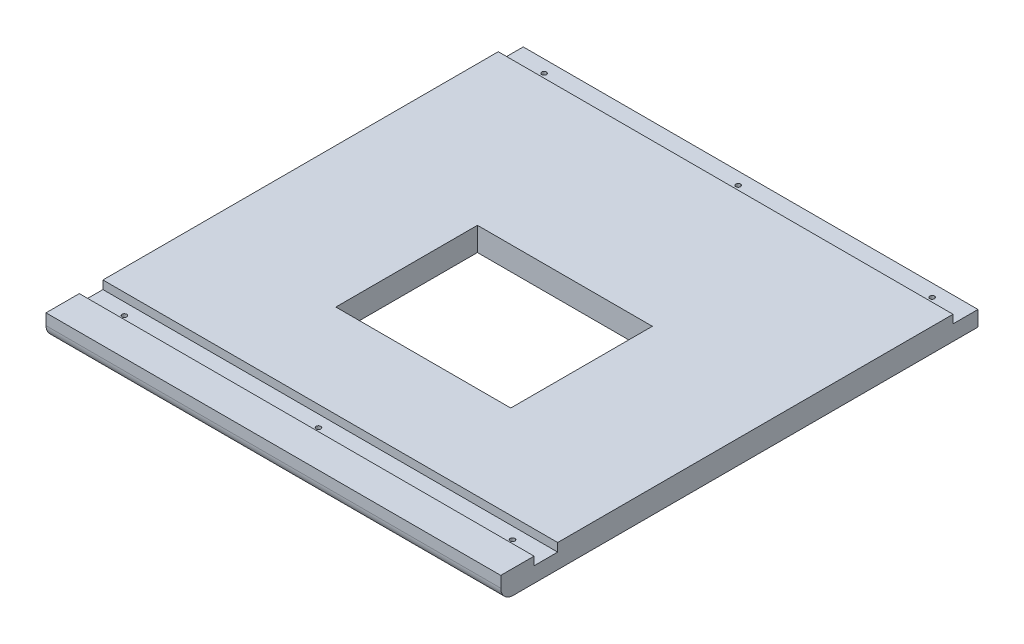
ISO-10303-21;
HEADER;
FILE_DESCRIPTION(('STEP AP214'),'2;1');
FILE_NAME('part.step','',(''),(''),'','','');
FILE_SCHEMA(('AUTOMOTIVE_DESIGN { 1 0 10303 214 1 1 1 1 }'));
ENDSEC;
DATA;
#1=APPLICATION_CONTEXT('core data for automotive mechanical design processes');
#2=APPLICATION_PROTOCOL_DEFINITION('international standard','automotive_design',2000,#1);
#3=PRODUCT_CONTEXT('',#1,'mechanical');
#4=PRODUCT('Part','Part','',(#3));
#5=PRODUCT_RELATED_PRODUCT_CATEGORY('part','',(#4));
#6=PRODUCT_DEFINITION_FORMATION('','',#4);
#7=PRODUCT_DEFINITION_CONTEXT('part definition',#1,'design');
#8=PRODUCT_DEFINITION('design','',#6,#7);
#9=PRODUCT_DEFINITION_SHAPE('','',#8);
#10=(LENGTH_UNIT() NAMED_UNIT(*) SI_UNIT(.MILLI.,.METRE.));
#11=(NAMED_UNIT(*) PLANE_ANGLE_UNIT() SI_UNIT($,.RADIAN.));
#12=(NAMED_UNIT(*) SI_UNIT($,.STERADIAN.) SOLID_ANGLE_UNIT());
#13=UNCERTAINTY_MEASURE_WITH_UNIT(LENGTH_MEASURE(1.E-05),#10,'distance_accuracy_value','');
#14=(GEOMETRIC_REPRESENTATION_CONTEXT(3) GLOBAL_UNCERTAINTY_ASSIGNED_CONTEXT((#13)) GLOBAL_UNIT_ASSIGNED_CONTEXT((#10,
#11,#12)) REPRESENTATION_CONTEXT('',''));
#15=CARTESIAN_POINT('',(0.,0.,0.));
#16=DIRECTION('',(0.,0.,1.));
#17=DIRECTION('',(1.,0.,0.));
#18=AXIS2_PLACEMENT_3D('',#15,#16,#17);
#19=CARTESIAN_POINT('',(0.,18.,0.));
#20=DIRECTION('',(0.,0.,1.));
#21=DIRECTION('',(1.,0.,0.));
#22=AXIS2_PLACEMENT_3D('',#19,#20,#21);
#23=PLANE('',#22);
#24=DIRECTION('',(1.,0.,0.));
#25=VECTOR('',#24,1.);
#26=CARTESIAN_POINT('',(0.,11.65,0.));
#27=LINE('',#26,#25);
#28=CARTESIAN_POINT('',(0.,11.65,0.));
#29=VERTEX_POINT('',#28);
#30=CARTESIAN_POINT('',(346.7,11.65,0.));
#31=VERTEX_POINT('',#30);
#32=EDGE_CURVE('E197',#29,#31,#27,.T.);
#33=ORIENTED_EDGE('',*,*,#32,.T.);
#34=DIRECTION('',(0.,-1.,0.));
#35=VECTOR('',#34,1.);
#36=CARTESIAN_POINT('',(346.7,18.,0.));
#37=LINE('',#36,#35);
#38=CARTESIAN_POINT('',(346.7,0.,0.));
#39=VERTEX_POINT('',#38);
#40=EDGE_CURVE('E162',#31,#39,#37,.T.);
#41=ORIENTED_EDGE('',*,*,#40,.T.);
#42=DIRECTION('',(-1.,0.,0.));
#43=VECTOR('',#42,1.);
#44=CARTESIAN_POINT('',(0.,0.,0.));
#45=LINE('',#44,#43);
#46=CARTESIAN_POINT('',(0.,0.,0.));
#47=VERTEX_POINT('',#46);
#48=EDGE_CURVE('E173',#39,#47,#45,.T.);
#49=ORIENTED_EDGE('',*,*,#48,.T.);
#50=DIRECTION('',(0.,-1.,0.));
#51=VECTOR('',#50,1.);
#52=CARTESIAN_POINT('',(0.,18.,0.));
#53=LINE('',#52,#51);
#54=EDGE_CURVE('E159',#29,#47,#53,.T.);
#55=ORIENTED_EDGE('',*,*,#54,.F.);
#56=EDGE_LOOP('',(#33,#41,#49,#55));
#57=FACE_BOUND('',#56,.T.);
#58=ADVANCED_FACE('F33',(#57),#23,.F.);
#59=CARTESIAN_POINT('',(0.,18.,0.));
#60=DIRECTION('',(0.,1.,0.));
#61=DIRECTION('',(0.,0.,1.));
#62=AXIS2_PLACEMENT_3D('',#59,#60,#61);
#63=PLANE('',#62);
#64=DIRECTION('',(-1.,0.,0.));
#65=VECTOR('',#64,1.);
#66=CARTESIAN_POINT('',(0.,18.,363.85000001));
#67=LINE('',#66,#65);
#68=CARTESIAN_POINT('',(346.7,18.,363.85000001));
#69=VERTEX_POINT('',#68);
#70=CARTESIAN_POINT('',(0.,18.,363.85000001));
#71=VERTEX_POINT('',#70);
#72=EDGE_CURVE('E139',#69,#71,#67,.T.);
#73=ORIENTED_EDGE('',*,*,#72,.F.);
#74=DIRECTION('',(0.,0.,-1.));
#75=VECTOR('',#74,1.);
#76=CARTESIAN_POINT('',(346.7,18.,0.));
#77=LINE('',#76,#75);
#78=CARTESIAN_POINT('',(346.7,18.,338.45000001));
#79=VERTEX_POINT('',#78);
#80=EDGE_CURVE('E149',#69,#79,#77,.T.);
#81=ORIENTED_EDGE('',*,*,#80,.T.);
#82=DIRECTION('',(1.,0.,0.));
#83=VECTOR('',#82,1.);
#84=CARTESIAN_POINT('',(346.7,18.,338.45000001));
#85=LINE('',#84,#83);
#86=CARTESIAN_POINT('',(0.,18.,338.45000001));
#87=VERTEX_POINT('',#86);
#88=EDGE_CURVE('E469',#87,#79,#85,.T.);
#89=ORIENTED_EDGE('',*,*,#88,.F.);
#90=DIRECTION('',(0.,0.,1.));
#91=VECTOR('',#90,1.);
#92=CARTESIAN_POINT('',(0.,18.,0.));
#93=LINE('',#92,#91);
#94=EDGE_CURVE('E152',#87,#71,#93,.T.);
#95=ORIENTED_EDGE('',*,*,#94,.T.);
#96=EDGE_LOOP('',(#73,#81,#89,#95));
#97=FACE_BOUND('',#96,.T.);
#98=ADVANCED_FACE('F147',(#97),#63,.T.);
#99=CARTESIAN_POINT('',(0.,18.,0.));
#100=DIRECTION('',(1.,0.,0.));
#101=DIRECTION('',(0.,0.,-1.));
#102=AXIS2_PLACEMENT_3D('',#99,#100,#101);
#103=PLANE('',#102);
#104=DIRECTION('',(0.,0.,1.));
#105=VECTOR('',#104,1.);
#106=CARTESIAN_POINT('',(0.,0.,0.));
#107=LINE('',#106,#105);
#108=CARTESIAN_POINT('',(0.,0.,354.32500001));
#109=VERTEX_POINT('',#108);
#110=EDGE_CURVE('E169',#47,#109,#107,.T.);
#111=ORIENTED_EDGE('',*,*,#110,.T.);
#112=CARTESIAN_POINT('',(0.,9.525,354.32500001));
#113=DIRECTION('',(1.,0.,0.));
#114=DIRECTION('',(0.,0.,-1.));
#115=AXIS2_PLACEMENT_3D('',#112,#113,#114);
#116=CIRCLE('',#115,9.525);
#117=CARTESIAN_POINT('',(0.,9.525,363.85000001));
#118=VERTEX_POINT('',#117);
#119=EDGE_CURVE('E55',#109,#118,#116,.F.);
#120=ORIENTED_EDGE('',*,*,#119,.T.);
#121=DIRECTION('',(0.,1.,0.));
#122=VECTOR('',#121,1.);
#123=CARTESIAN_POINT('',(0.,0.,363.85000001));
#124=LINE('',#123,#122);
#125=EDGE_CURVE('E144',#118,#71,#124,.T.);
#126=ORIENTED_EDGE('',*,*,#125,.T.);
#127=ORIENTED_EDGE('',*,*,#94,.F.);
#128=DIRECTION('',(0.,1.,0.));
#129=VECTOR('',#128,1.);
#130=CARTESIAN_POINT('',(0.,11.65,338.45000001));
#131=LINE('',#130,#129);
#132=CARTESIAN_POINT('',(0.,11.65,338.45000001));
#133=VERTEX_POINT('',#132);
#134=EDGE_CURVE('E482',#133,#87,#131,.T.);
#135=ORIENTED_EDGE('',*,*,#134,.F.);
#136=DIRECTION('',(0.,0.,1.));
#137=VECTOR('',#136,1.);
#138=CARTESIAN_POINT('',(0.,11.65,338.45000001));
#139=LINE('',#138,#137);
#140=CARTESIAN_POINT('',(0.,11.65,320.45000001));
#141=VERTEX_POINT('',#140);
#142=EDGE_CURVE('E472',#141,#133,#139,.T.);
#143=ORIENTED_EDGE('',*,*,#142,.F.);
#144=DIRECTION('',(0.,1.,0.));
#145=VECTOR('',#144,1.);
#146=CARTESIAN_POINT('',(0.,11.65,320.45000001));
#147=LINE('',#146,#145);
#148=CARTESIAN_POINT('',(0.,18.,320.45000001));
#149=VERTEX_POINT('',#148);
#150=EDGE_CURVE('E484',#141,#149,#147,.T.);
#151=ORIENTED_EDGE('',*,*,#150,.T.);
#152=CARTESIAN_POINT('',(0.,18.,19.05));
#153=VERTEX_POINT('',#152);
#154=EDGE_CURVE('E165',#153,#149,#93,.T.);
#155=ORIENTED_EDGE('',*,*,#154,.F.);
#156=DIRECTION('',(0.,1.,0.));
#157=VECTOR('',#156,1.);
#158=CARTESIAN_POINT('',(0.,-335.572972310301,19.05));
#159=LINE('',#158,#157);
#160=CARTESIAN_POINT('',(0.,11.65,19.05));
#161=VERTEX_POINT('',#160);
#162=EDGE_CURVE('E428',#161,#153,#159,.T.);
#163=ORIENTED_EDGE('',*,*,#162,.F.);
#164=DIRECTION('',(0.,0.,-1.));
#165=VECTOR('',#164,1.);
#166=CARTESIAN_POINT('',(0.,11.65,0.));
#167=LINE('',#166,#165);
#168=EDGE_CURVE('E193',#161,#29,#167,.T.);
#169=ORIENTED_EDGE('',*,*,#168,.T.);
#170=ORIENTED_EDGE('',*,*,#54,.T.);
#171=EDGE_LOOP('',(#111,#120,#126,#127,#135,#143,#151,#155,#163,#169,#170));
#172=FACE_BOUND('',#171,.T.);
#173=ADVANCED_FACE('F188',(#172),#103,.F.);
#174=CARTESIAN_POINT('',(346.7,18.,0.));
#175=DIRECTION('',(-1.,0.,0.));
#176=DIRECTION('',(0.,0.,1.));
#177=AXIS2_PLACEMENT_3D('',#174,#175,#176);
#178=PLANE('',#177);
#179=DIRECTION('',(0.,1.,0.));
#180=VECTOR('',#179,1.);
#181=CARTESIAN_POINT('',(346.7,0.,363.85000001));
#182=LINE('',#181,#180);
#183=CARTESIAN_POINT('',(346.7,9.525,363.85000001));
#184=VERTEX_POINT('',#183);
#185=EDGE_CURVE('E136',#184,#69,#182,.T.);
#186=ORIENTED_EDGE('',*,*,#185,.F.);
#187=CARTESIAN_POINT('',(346.7,9.525,354.32500001));
#188=DIRECTION('',(-1.,0.,0.));
#189=DIRECTION('',(0.,0.,1.));
#190=AXIS2_PLACEMENT_3D('',#187,#188,#189);
#191=CIRCLE('',#190,9.525);
#192=CARTESIAN_POINT('',(346.7,0.,354.32500001));
#193=VERTEX_POINT('',#192);
#194=EDGE_CURVE('E11',#184,#193,#191,.F.);
#195=ORIENTED_EDGE('',*,*,#194,.T.);
#196=DIRECTION('',(0.,0.,-1.));
#197=VECTOR('',#196,1.);
#198=CARTESIAN_POINT('',(346.7,0.,0.));
#199=LINE('',#198,#197);
#200=EDGE_CURVE('E171',#193,#39,#199,.T.);
#201=ORIENTED_EDGE('',*,*,#200,.T.);
#202=ORIENTED_EDGE('',*,*,#40,.F.);
#203=DIRECTION('',(0.,0.,1.));
#204=VECTOR('',#203,1.);
#205=CARTESIAN_POINT('',(346.7,11.65,0.));
#206=LINE('',#205,#204);
#207=CARTESIAN_POINT('',(346.7,11.65,19.05));
#208=VERTEX_POINT('',#207);
#209=EDGE_CURVE('E200',#31,#208,#206,.T.);
#210=ORIENTED_EDGE('',*,*,#209,.T.);
#211=DIRECTION('',(0.,1.,0.));
#212=VECTOR('',#211,1.);
#213=CARTESIAN_POINT('',(346.7,-335.572972310301,19.05));
#214=LINE('',#213,#212);
#215=CARTESIAN_POINT('',(346.7,18.,19.05));
#216=VERTEX_POINT('',#215);
#217=EDGE_CURVE('E423',#208,#216,#214,.T.);
#218=ORIENTED_EDGE('',*,*,#217,.T.);
#219=CARTESIAN_POINT('',(346.7,18.,320.45000001));
#220=VERTEX_POINT('',#219);
#221=EDGE_CURVE('E160',#220,#216,#77,.T.);
#222=ORIENTED_EDGE('',*,*,#221,.F.);
#223=DIRECTION('',(0.,1.,0.));
#224=VECTOR('',#223,1.);
#225=CARTESIAN_POINT('',(346.7,11.65,320.45000001));
#226=LINE('',#225,#224);
#227=CARTESIAN_POINT('',(346.7,11.65,320.45000001));
#228=VERTEX_POINT('',#227);
#229=EDGE_CURVE('E477',#228,#220,#226,.T.);
#230=ORIENTED_EDGE('',*,*,#229,.F.);
#231=DIRECTION('',(0.,0.,-1.));
#232=VECTOR('',#231,1.);
#233=CARTESIAN_POINT('',(346.7,11.65,338.45000001));
#234=LINE('',#233,#232);
#235=CARTESIAN_POINT('',(346.7,11.65,338.45000001));
#236=VERTEX_POINT('',#235);
#237=EDGE_CURVE('E465',#236,#228,#234,.T.);
#238=ORIENTED_EDGE('',*,*,#237,.F.);
#239=DIRECTION('',(0.,1.,0.));
#240=VECTOR('',#239,1.);
#241=CARTESIAN_POINT('',(346.7,11.65,338.45000001));
#242=LINE('',#241,#240);
#243=EDGE_CURVE('E158',#236,#79,#242,.T.);
#244=ORIENTED_EDGE('',*,*,#243,.T.);
#245=ORIENTED_EDGE('',*,*,#80,.F.);
#246=EDGE_LOOP('',(#186,#195,#201,#202,#210,#218,#222,#230,#238,#244,#245));
#247=FACE_BOUND('',#246,.T.);
#248=ADVANCED_FACE('F156',(#247),#178,.F.);
#249=DIRECTION('',(1.,0.,0.));
#250=VECTOR('',#249,1.);
#251=CARTESIAN_POINT('',(0.,18.,19.05));
#252=LINE('',#251,#250);
#253=EDGE_CURVE('E420',#153,#216,#252,.T.);
#254=ORIENTED_EDGE('',*,*,#253,.F.);
#255=ORIENTED_EDGE('',*,*,#154,.T.);
#256=DIRECTION('',(-1.,0.,0.));
#257=VECTOR('',#256,1.);
#258=CARTESIAN_POINT('',(346.7,18.,320.45000001));
#259=LINE('',#258,#257);
#260=EDGE_CURVE('E458',#220,#149,#259,.T.);
#261=ORIENTED_EDGE('',*,*,#260,.F.);
#262=ORIENTED_EDGE('',*,*,#221,.T.);
#263=EDGE_LOOP('',(#254,#255,#261,#262));
#264=FACE_BOUND('',#263,.T.);
#265=DIRECTION('',(0.,0.,1.));
#266=VECTOR('',#265,1.);
#267=CARTESIAN_POINT('',(106.675,18.,249.55000001));
#268=LINE('',#267,#266);
#269=CARTESIAN_POINT('',(106.675,18.,141.60000001));
#270=VERTEX_POINT('',#269);
#271=CARTESIAN_POINT('',(106.675,18.,249.55000001));
#272=VERTEX_POINT('',#271);
#273=EDGE_CURVE('E432',#270,#272,#268,.T.);
#274=ORIENTED_EDGE('',*,*,#273,.F.);
#275=DIRECTION('',(-1.,0.,0.));
#276=VECTOR('',#275,1.);
#277=CARTESIAN_POINT('',(106.675,18.,141.60000001));
#278=LINE('',#277,#276);
#279=CARTESIAN_POINT('',(240.025,18.,141.60000001));
#280=VERTEX_POINT('',#279);
#281=EDGE_CURVE('E437',#280,#270,#278,.T.);
#282=ORIENTED_EDGE('',*,*,#281,.F.);
#283=DIRECTION('',(0.,0.,-1.));
#284=VECTOR('',#283,1.);
#285=CARTESIAN_POINT('',(240.025,18.,249.55000001));
#286=LINE('',#285,#284);
#287=CARTESIAN_POINT('',(240.025,18.,249.55000001));
#288=VERTEX_POINT('',#287);
#289=EDGE_CURVE('E451',#288,#280,#286,.T.);
#290=ORIENTED_EDGE('',*,*,#289,.F.);
#291=DIRECTION('',(1.,0.,0.));
#292=VECTOR('',#291,1.);
#293=CARTESIAN_POINT('',(106.675,18.,249.55000001));
#294=LINE('',#293,#292);
#295=EDGE_CURVE('E448',#272,#288,#294,.T.);
#296=ORIENTED_EDGE('',*,*,#295,.F.);
#297=EDGE_LOOP('',(#274,#282,#290,#296));
#298=FACE_BOUND('',#297,.T.);
#299=ADVANCED_FACE('F218',(#264,#298),#63,.T.);
#300=CARTESIAN_POINT('',(0.,0.,0.));
#301=DIRECTION('',(0.,1.,0.));
#302=DIRECTION('',(0.,0.,1.));
#303=AXIS2_PLACEMENT_3D('',#300,#301,#302);
#304=PLANE('',#303);
#305=CARTESIAN_POINT('',(25.4,0.,9.525));
#306=DIRECTION('',(0.,1.,0.));
#307=DIRECTION('',(0.,0.,1.));
#308=AXIS2_PLACEMENT_3D('',#305,#306,#307);
#309=CIRCLE('',#308,1.7859375);
#310=CARTESIAN_POINT('',(25.4,0.,11.3109375));
#311=VERTEX_POINT('',#310);
#312=EDGE_CURVE('E384',#311,#311,#309,.T.);
#313=ORIENTED_EDGE('',*,*,#312,.T.);
#314=EDGE_LOOP('',(#313));
#315=FACE_BOUND('',#314,.T.);
#316=CARTESIAN_POINT('',(321.3,0.,9.52499999999996));
#317=DIRECTION('',(0.,1.,0.));
#318=DIRECTION('',(0.,0.,1.));
#319=AXIS2_PLACEMENT_3D('',#316,#317,#318);
#320=CIRCLE('',#319,1.78593749999999);
#321=CARTESIAN_POINT('',(321.3,0.,11.3109375));
#322=VERTEX_POINT('',#321);
#323=EDGE_CURVE('E392',#322,#322,#320,.T.);
#324=ORIENTED_EDGE('',*,*,#323,.T.);
#325=EDGE_LOOP('',(#324));
#326=FACE_BOUND('',#325,.T.);
#327=CARTESIAN_POINT('',(321.3,0.,329.45000001));
#328=DIRECTION('',(0.,1.,0.));
#329=DIRECTION('',(0.,0.,1.));
#330=AXIS2_PLACEMENT_3D('',#327,#328,#329);
#331=CIRCLE('',#330,1.7859375);
#332=CARTESIAN_POINT('',(321.3,0.,331.23593751));
#333=VERTEX_POINT('',#332);
#334=EDGE_CURVE('E398',#333,#333,#331,.T.);
#335=ORIENTED_EDGE('',*,*,#334,.T.);
#336=EDGE_LOOP('',(#335));
#337=FACE_BOUND('',#336,.T.);
#338=CARTESIAN_POINT('',(25.4,0.,329.45000001));
#339=DIRECTION('',(0.,1.,0.));
#340=DIRECTION('',(0.,0.,1.));
#341=AXIS2_PLACEMENT_3D('',#338,#339,#340);
#342=CIRCLE('',#341,1.78593750000001);
#343=CARTESIAN_POINT('',(25.4,0.,331.23593751));
#344=VERTEX_POINT('',#343);
#345=EDGE_CURVE('E404',#344,#344,#342,.T.);
#346=ORIENTED_EDGE('',*,*,#345,.T.);
#347=EDGE_LOOP('',(#346));
#348=FACE_BOUND('',#347,.T.);
#349=CARTESIAN_POINT('',(173.35,0.,329.45000001));
#350=DIRECTION('',(0.,1.,0.));
#351=DIRECTION('',(0.,0.,1.));
#352=AXIS2_PLACEMENT_3D('',#349,#350,#351);
#353=CIRCLE('',#352,1.7859375);
#354=CARTESIAN_POINT('',(173.35,0.,331.23593751));
#355=VERTEX_POINT('',#354);
#356=EDGE_CURVE('E410',#355,#355,#353,.T.);
#357=ORIENTED_EDGE('',*,*,#356,.T.);
#358=EDGE_LOOP('',(#357));
#359=FACE_BOUND('',#358,.T.);
#360=CARTESIAN_POINT('',(173.35,0.,9.525));
#361=DIRECTION('',(0.,1.,0.));
#362=DIRECTION('',(0.,0.,1.));
#363=AXIS2_PLACEMENT_3D('',#360,#361,#362);
#364=CIRCLE('',#363,1.78593749999999);
#365=CARTESIAN_POINT('',(173.35,0.,11.3109375));
#366=VERTEX_POINT('',#365);
#367=EDGE_CURVE('E153',#366,#366,#364,.T.);
#368=ORIENTED_EDGE('',*,*,#367,.T.);
#369=EDGE_LOOP('',(#368));
#370=FACE_BOUND('',#369,.T.);
#371=DIRECTION('',(-1.,0.,0.));
#372=VECTOR('',#371,1.);
#373=CARTESIAN_POINT('',(106.675,0.,141.60000001));
#374=LINE('',#373,#372);
#375=CARTESIAN_POINT('',(240.025,0.,141.60000001));
#376=VERTEX_POINT('',#375);
#377=CARTESIAN_POINT('',(106.675,0.,141.60000001));
#378=VERTEX_POINT('',#377);
#379=EDGE_CURVE('E443',#376,#378,#374,.T.);
#380=ORIENTED_EDGE('',*,*,#379,.T.);
#381=DIRECTION('',(0.,0.,1.));
#382=VECTOR('',#381,1.);
#383=CARTESIAN_POINT('',(106.675,0.,249.55000001));
#384=LINE('',#383,#382);
#385=CARTESIAN_POINT('',(106.675,0.,249.55000001));
#386=VERTEX_POINT('',#385);
#387=EDGE_CURVE('E433',#378,#386,#384,.T.);
#388=ORIENTED_EDGE('',*,*,#387,.T.);
#389=DIRECTION('',(1.,0.,0.));
#390=VECTOR('',#389,1.);
#391=CARTESIAN_POINT('',(106.675,0.,249.55000001));
#392=LINE('',#391,#390);
#393=CARTESIAN_POINT('',(240.025,0.,249.55000001));
#394=VERTEX_POINT('',#393);
#395=EDGE_CURVE('E436',#386,#394,#392,.T.);
#396=ORIENTED_EDGE('',*,*,#395,.T.);
#397=DIRECTION('',(0.,0.,-1.));
#398=VECTOR('',#397,1.);
#399=CARTESIAN_POINT('',(240.025,0.,249.55000001));
#400=LINE('',#399,#398);
#401=EDGE_CURVE('E440',#394,#376,#400,.T.);
#402=ORIENTED_EDGE('',*,*,#401,.T.);
#403=EDGE_LOOP('',(#380,#388,#396,#402));
#404=FACE_BOUND('',#403,.T.);
#405=ORIENTED_EDGE('',*,*,#200,.F.);
#406=DIRECTION('',(-1.,0.,0.));
#407=VECTOR('',#406,1.);
#408=CARTESIAN_POINT('',(0.,0.,354.32500001));
#409=LINE('',#408,#407);
#410=EDGE_CURVE('E178',#193,#109,#409,.T.);
#411=ORIENTED_EDGE('',*,*,#410,.T.);
#412=ORIENTED_EDGE('',*,*,#110,.F.);
#413=ORIENTED_EDGE('',*,*,#48,.F.);
#414=EDGE_LOOP('',(#405,#411,#412,#413));
#415=FACE_BOUND('',#414,.T.);
#416=ADVANCED_FACE('F185',(#315,#326,#337,#348,#359,#370,#404,#415),#304,.F.);
#417=CARTESIAN_POINT('',(346.7,11.65,338.45000001));
#418=DIRECTION('',(0.,0.,1.));
#419=DIRECTION('',(1.,0.,0.));
#420=AXIS2_PLACEMENT_3D('',#417,#418,#419);
#421=PLANE('',#420);
#422=ORIENTED_EDGE('',*,*,#88,.T.);
#423=ORIENTED_EDGE('',*,*,#243,.F.);
#424=DIRECTION('',(1.,0.,0.));
#425=VECTOR('',#424,1.);
#426=CARTESIAN_POINT('',(346.7,11.65,338.45000001));
#427=LINE('',#426,#425);
#428=EDGE_CURVE('E474',#133,#236,#427,.T.);
#429=ORIENTED_EDGE('',*,*,#428,.F.);
#430=ORIENTED_EDGE('',*,*,#134,.T.);
#431=EDGE_LOOP('',(#422,#423,#429,#430));
#432=FACE_BOUND('',#431,.T.);
#433=ADVANCED_FACE('F245',(#432),#421,.F.);
#434=CARTESIAN_POINT('',(346.7,11.65,320.45000001));
#435=DIRECTION('',(0.,0.,-1.));
#436=DIRECTION('',(-1.,0.,0.));
#437=AXIS2_PLACEMENT_3D('',#434,#435,#436);
#438=PLANE('',#437);
#439=ORIENTED_EDGE('',*,*,#260,.T.);
#440=ORIENTED_EDGE('',*,*,#150,.F.);
#441=DIRECTION('',(-1.,0.,0.));
#442=VECTOR('',#441,1.);
#443=CARTESIAN_POINT('',(346.7,11.65,320.45000001));
#444=LINE('',#443,#442);
#445=EDGE_CURVE('E468',#228,#141,#444,.T.);
#446=ORIENTED_EDGE('',*,*,#445,.F.);
#447=ORIENTED_EDGE('',*,*,#229,.T.);
#448=EDGE_LOOP('',(#439,#440,#446,#447));
#449=FACE_BOUND('',#448,.T.);
#450=ADVANCED_FACE('F253',(#449),#438,.F.);
#451=CARTESIAN_POINT('',(0.,11.65,0.));
#452=DIRECTION('',(0.,1.,0.));
#453=DIRECTION('',(0.,0.,1.));
#454=AXIS2_PLACEMENT_3D('',#451,#452,#453);
#455=PLANE('',#454);
#456=CARTESIAN_POINT('',(321.3,11.65,329.45000001));
#457=DIRECTION('',(0.,1.,0.));
#458=DIRECTION('',(0.,0.,1.));
#459=AXIS2_PLACEMENT_3D('',#456,#457,#458);
#460=CIRCLE('',#459,1.7859375);
#461=CARTESIAN_POINT('',(321.3,11.65,331.23593751));
#462=VERTEX_POINT('',#461);
#463=EDGE_CURVE('E395',#462,#462,#460,.T.);
#464=ORIENTED_EDGE('',*,*,#463,.F.);
#465=EDGE_LOOP('',(#464));
#466=FACE_BOUND('',#465,.T.);
#467=CARTESIAN_POINT('',(25.4,11.65,329.45000001));
#468=DIRECTION('',(0.,1.,0.));
#469=DIRECTION('',(0.,0.,1.));
#470=AXIS2_PLACEMENT_3D('',#467,#468,#469);
#471=CIRCLE('',#470,1.78593750000001);
#472=CARTESIAN_POINT('',(25.4,11.65,331.23593751));
#473=VERTEX_POINT('',#472);
#474=EDGE_CURVE('E401',#473,#473,#471,.T.);
#475=ORIENTED_EDGE('',*,*,#474,.F.);
#476=EDGE_LOOP('',(#475));
#477=FACE_BOUND('',#476,.T.);
#478=CARTESIAN_POINT('',(173.35,11.65,329.45000001));
#479=DIRECTION('',(0.,1.,0.));
#480=DIRECTION('',(0.,0.,1.));
#481=AXIS2_PLACEMENT_3D('',#478,#479,#480);
#482=CIRCLE('',#481,1.7859375);
#483=CARTESIAN_POINT('',(173.35,11.65,331.23593751));
#484=VERTEX_POINT('',#483);
#485=EDGE_CURVE('E407',#484,#484,#482,.T.);
#486=ORIENTED_EDGE('',*,*,#485,.F.);
#487=EDGE_LOOP('',(#486));
#488=FACE_BOUND('',#487,.T.);
#489=ORIENTED_EDGE('',*,*,#237,.T.);
#490=ORIENTED_EDGE('',*,*,#445,.T.);
#491=ORIENTED_EDGE('',*,*,#142,.T.);
#492=ORIENTED_EDGE('',*,*,#428,.T.);
#493=EDGE_LOOP('',(#489,#490,#491,#492));
#494=FACE_BOUND('',#493,.T.);
#495=ADVANCED_FACE('F261',(#466,#477,#488,#494),#455,.T.);
#496=CARTESIAN_POINT('',(106.675,0.,249.55000001));
#497=DIRECTION('',(-1.,0.,0.));
#498=DIRECTION('',(0.,0.,1.));
#499=AXIS2_PLACEMENT_3D('',#496,#497,#498);
#500=PLANE('',#499);
#501=ORIENTED_EDGE('',*,*,#273,.T.);
#502=DIRECTION('',(0.,1.,0.));
#503=VECTOR('',#502,1.);
#504=CARTESIAN_POINT('',(106.675,0.,249.55000001));
#505=LINE('',#504,#503);
#506=EDGE_CURVE('E446',#386,#272,#505,.T.);
#507=ORIENTED_EDGE('',*,*,#506,.F.);
#508=ORIENTED_EDGE('',*,*,#387,.F.);
#509=DIRECTION('',(0.,1.,0.));
#510=VECTOR('',#509,1.);
#511=CARTESIAN_POINT('',(106.675,0.,141.60000001));
#512=LINE('',#511,#510);
#513=EDGE_CURVE('E456',#378,#270,#512,.T.);
#514=ORIENTED_EDGE('',*,*,#513,.T.);
#515=EDGE_LOOP('',(#501,#507,#508,#514));
#516=FACE_BOUND('',#515,.T.);
#517=ADVANCED_FACE('F269',(#516),#500,.F.);
#518=CARTESIAN_POINT('',(106.675,0.,141.60000001));
#519=DIRECTION('',(0.,0.,-1.));
#520=DIRECTION('',(-1.,0.,0.));
#521=AXIS2_PLACEMENT_3D('',#518,#519,#520);
#522=PLANE('',#521);
#523=ORIENTED_EDGE('',*,*,#281,.T.);
#524=ORIENTED_EDGE('',*,*,#513,.F.);
#525=ORIENTED_EDGE('',*,*,#379,.F.);
#526=DIRECTION('',(0.,1.,0.));
#527=VECTOR('',#526,1.);
#528=CARTESIAN_POINT('',(240.025,0.,141.60000001));
#529=LINE('',#528,#527);
#530=EDGE_CURVE('E459',#376,#280,#529,.T.);
#531=ORIENTED_EDGE('',*,*,#530,.T.);
#532=EDGE_LOOP('',(#523,#524,#525,#531));
#533=FACE_BOUND('',#532,.T.);
#534=ADVANCED_FACE('F277',(#533),#522,.F.);
#535=CARTESIAN_POINT('',(240.025,0.,249.55000001));
#536=DIRECTION('',(1.,0.,0.));
#537=DIRECTION('',(0.,0.,-1.));
#538=AXIS2_PLACEMENT_3D('',#535,#536,#537);
#539=PLANE('',#538);
#540=ORIENTED_EDGE('',*,*,#289,.T.);
#541=ORIENTED_EDGE('',*,*,#530,.F.);
#542=ORIENTED_EDGE('',*,*,#401,.F.);
#543=DIRECTION('',(0.,1.,0.));
#544=VECTOR('',#543,1.);
#545=CARTESIAN_POINT('',(240.025,0.,249.55000001));
#546=LINE('',#545,#544);
#547=EDGE_CURVE('E461',#394,#288,#546,.T.);
#548=ORIENTED_EDGE('',*,*,#547,.T.);
#549=EDGE_LOOP('',(#540,#541,#542,#548));
#550=FACE_BOUND('',#549,.T.);
#551=ADVANCED_FACE('F285',(#550),#539,.F.);
#552=CARTESIAN_POINT('',(106.675,0.,249.55000001));
#553=DIRECTION('',(0.,0.,1.));
#554=DIRECTION('',(1.,0.,0.));
#555=AXIS2_PLACEMENT_3D('',#552,#553,#554);
#556=PLANE('',#555);
#557=ORIENTED_EDGE('',*,*,#295,.T.);
#558=ORIENTED_EDGE('',*,*,#547,.F.);
#559=ORIENTED_EDGE('',*,*,#395,.F.);
#560=ORIENTED_EDGE('',*,*,#506,.T.);
#561=EDGE_LOOP('',(#557,#558,#559,#560));
#562=FACE_BOUND('',#561,.T.);
#563=ADVANCED_FACE('F293',(#562),#556,.F.);
#564=CARTESIAN_POINT('',(0.,-335.572972310301,19.05));
#565=DIRECTION('',(0.,0.,1.));
#566=DIRECTION('',(1.,0.,0.));
#567=AXIS2_PLACEMENT_3D('',#564,#565,#566);
#568=PLANE('',#567);
#569=DIRECTION('',(-1.,0.,0.));
#570=VECTOR('',#569,1.);
#571=CARTESIAN_POINT('',(0.,11.65,19.05));
#572=LINE('',#571,#570);
#573=EDGE_CURVE('E426',#208,#161,#572,.T.);
#574=ORIENTED_EDGE('',*,*,#573,.T.);
#575=ORIENTED_EDGE('',*,*,#162,.T.);
#576=ORIENTED_EDGE('',*,*,#253,.T.);
#577=ORIENTED_EDGE('',*,*,#217,.F.);
#578=EDGE_LOOP('',(#574,#575,#576,#577));
#579=FACE_BOUND('',#578,.T.);
#580=ADVANCED_FACE('F301',(#579),#568,.F.);
#581=CARTESIAN_POINT('',(0.,11.65,0.));
#582=DIRECTION('',(0.,1.,0.));
#583=DIRECTION('',(0.,0.,1.));
#584=AXIS2_PLACEMENT_3D('',#581,#582,#583);
#585=PLANE('',#584);
#586=CARTESIAN_POINT('',(25.4,11.65,9.525));
#587=DIRECTION('',(0.,1.,0.));
#588=DIRECTION('',(0.,0.,1.));
#589=AXIS2_PLACEMENT_3D('',#586,#587,#588);
#590=CIRCLE('',#589,1.7859375);
#591=CARTESIAN_POINT('',(25.4,11.65,11.3109375));
#592=VERTEX_POINT('',#591);
#593=EDGE_CURVE('E387',#592,#592,#590,.T.);
#594=ORIENTED_EDGE('',*,*,#593,.F.);
#595=EDGE_LOOP('',(#594));
#596=FACE_BOUND('',#595,.T.);
#597=CARTESIAN_POINT('',(321.3,11.65,9.52499999999996));
#598=DIRECTION('',(0.,1.,0.));
#599=DIRECTION('',(0.,0.,1.));
#600=AXIS2_PLACEMENT_3D('',#597,#598,#599);
#601=CIRCLE('',#600,1.78593749999999);
#602=CARTESIAN_POINT('',(321.3,11.65,11.3109375));
#603=VERTEX_POINT('',#602);
#604=EDGE_CURVE('E389',#603,#603,#601,.T.);
#605=ORIENTED_EDGE('',*,*,#604,.F.);
#606=EDGE_LOOP('',(#605));
#607=FACE_BOUND('',#606,.T.);
#608=CARTESIAN_POINT('',(173.35,11.65,9.525));
#609=DIRECTION('',(0.,1.,0.));
#610=DIRECTION('',(0.,0.,1.));
#611=AXIS2_PLACEMENT_3D('',#608,#609,#610);
#612=CIRCLE('',#611,1.78593749999999);
#613=CARTESIAN_POINT('',(173.35,11.65,11.3109375));
#614=VERTEX_POINT('',#613);
#615=EDGE_CURVE('E413',#614,#614,#612,.T.);
#616=ORIENTED_EDGE('',*,*,#615,.F.);
#617=EDGE_LOOP('',(#616));
#618=FACE_BOUND('',#617,.T.);
#619=ORIENTED_EDGE('',*,*,#168,.F.);
#620=ORIENTED_EDGE('',*,*,#573,.F.);
#621=ORIENTED_EDGE('',*,*,#209,.F.);
#622=ORIENTED_EDGE('',*,*,#32,.F.);
#623=EDGE_LOOP('',(#619,#620,#621,#622));
#624=FACE_BOUND('',#623,.T.);
#625=ADVANCED_FACE('F210',(#596,#607,#618,#624),#585,.T.);
#626=CARTESIAN_POINT('',(0.,0.,363.85000001));
#627=DIRECTION('',(0.,0.,-1.));
#628=DIRECTION('',(-1.,0.,0.));
#629=AXIS2_PLACEMENT_3D('',#626,#627,#628);
#630=PLANE('',#629);
#631=ORIENTED_EDGE('',*,*,#125,.F.);
#632=DIRECTION('',(-1.,0.,0.));
#633=VECTOR('',#632,1.);
#634=CARTESIAN_POINT('',(0.,9.525,363.85000001));
#635=LINE('',#634,#633);
#636=EDGE_CURVE('E41',#118,#184,#635,.F.);
#637=ORIENTED_EDGE('',*,*,#636,.T.);
#638=ORIENTED_EDGE('',*,*,#185,.T.);
#639=ORIENTED_EDGE('',*,*,#72,.T.);
#640=EDGE_LOOP('',(#631,#637,#638,#639));
#641=FACE_BOUND('',#640,.T.);
#642=ADVANCED_FACE('F138',(#641),#630,.F.);
#643=CARTESIAN_POINT('',(0.,9.525,354.32500001));
#644=DIRECTION('',(-1.,0.,0.));
#645=DIRECTION('',(0.,0.,1.));
#646=AXIS2_PLACEMENT_3D('',#643,#644,#645);
#647=CYLINDRICAL_SURFACE('',#646,9.525);
#648=ORIENTED_EDGE('',*,*,#194,.F.);
#649=ORIENTED_EDGE('',*,*,#636,.F.);
#650=ORIENTED_EDGE('',*,*,#119,.F.);
#651=ORIENTED_EDGE('',*,*,#410,.F.);
#652=EDGE_LOOP('',(#648,#649,#650,#651));
#653=FACE_BOUND('',#652,.T.);
#654=ADVANCED_FACE('F35',(#653),#647,.T.);
#655=CARTESIAN_POINT('',(173.35,0.,9.525));
#656=DIRECTION('',(0.,1.,0.));
#657=DIRECTION('',(0.,0.,1.));
#658=AXIS2_PLACEMENT_3D('',#655,#656,#657);
#659=CYLINDRICAL_SURFACE('',#658,1.78593749999999);
#660=ORIENTED_EDGE('',*,*,#367,.F.);
#661=EDGE_LOOP('',(#660));
#662=FACE_BOUND('',#661,.T.);
#663=ORIENTED_EDGE('',*,*,#615,.T.);
#664=EDGE_LOOP('',(#663));
#665=FACE_BOUND('',#664,.T.);
#666=ADVANCED_FACE('F202',(#662,#665),#659,.F.);
#667=CARTESIAN_POINT('',(173.35,0.,329.45000001));
#668=DIRECTION('',(0.,1.,0.));
#669=DIRECTION('',(0.,0.,1.));
#670=AXIS2_PLACEMENT_3D('',#667,#668,#669);
#671=CYLINDRICAL_SURFACE('',#670,1.7859375);
#672=ORIENTED_EDGE('',*,*,#356,.F.);
#673=EDGE_LOOP('',(#672));
#674=FACE_BOUND('',#673,.T.);
#675=ORIENTED_EDGE('',*,*,#485,.T.);
#676=EDGE_LOOP('',(#675));
#677=FACE_BOUND('',#676,.T.);
#678=ADVANCED_FACE('F207',(#674,#677),#671,.F.);
#679=CARTESIAN_POINT('',(25.4,0.,329.45000001));
#680=DIRECTION('',(0.,1.,0.));
#681=DIRECTION('',(0.,0.,1.));
#682=AXIS2_PLACEMENT_3D('',#679,#680,#681);
#683=CYLINDRICAL_SURFACE('',#682,1.78593750000001);
#684=ORIENTED_EDGE('',*,*,#345,.F.);
#685=EDGE_LOOP('',(#684));
#686=FACE_BOUND('',#685,.T.);
#687=ORIENTED_EDGE('',*,*,#474,.T.);
#688=EDGE_LOOP('',(#687));
#689=FACE_BOUND('',#688,.T.);
#690=ADVANCED_FACE('F337',(#686,#689),#683,.F.);
#691=CARTESIAN_POINT('',(321.3,0.,329.45000001));
#692=DIRECTION('',(0.,1.,0.));
#693=DIRECTION('',(0.,0.,1.));
#694=AXIS2_PLACEMENT_3D('',#691,#692,#693);
#695=CYLINDRICAL_SURFACE('',#694,1.7859375);
#696=ORIENTED_EDGE('',*,*,#334,.F.);
#697=EDGE_LOOP('',(#696));
#698=FACE_BOUND('',#697,.T.);
#699=ORIENTED_EDGE('',*,*,#463,.T.);
#700=EDGE_LOOP('',(#699));
#701=FACE_BOUND('',#700,.T.);
#702=ADVANCED_FACE('F346',(#698,#701),#695,.F.);
#703=CARTESIAN_POINT('',(321.3,0.,9.52499999999996));
#704=DIRECTION('',(0.,1.,0.));
#705=DIRECTION('',(0.,0.,1.));
#706=AXIS2_PLACEMENT_3D('',#703,#704,#705);
#707=CYLINDRICAL_SURFACE('',#706,1.78593749999999);
#708=ORIENTED_EDGE('',*,*,#323,.F.);
#709=EDGE_LOOP('',(#708));
#710=FACE_BOUND('',#709,.T.);
#711=ORIENTED_EDGE('',*,*,#604,.T.);
#712=EDGE_LOOP('',(#711));
#713=FACE_BOUND('',#712,.T.);
#714=ADVANCED_FACE('F355',(#710,#713),#707,.F.);
#715=CARTESIAN_POINT('',(25.4,0.,9.525));
#716=DIRECTION('',(0.,1.,0.));
#717=DIRECTION('',(0.,0.,1.));
#718=AXIS2_PLACEMENT_3D('',#715,#716,#717);
#719=CYLINDRICAL_SURFACE('',#718,1.7859375);
#720=ORIENTED_EDGE('',*,*,#312,.F.);
#721=EDGE_LOOP('',(#720));
#722=FACE_BOUND('',#721,.T.);
#723=ORIENTED_EDGE('',*,*,#593,.T.);
#724=EDGE_LOOP('',(#723));
#725=FACE_BOUND('',#724,.T.);
#726=ADVANCED_FACE('F364',(#722,#725),#719,.F.);
#727=CLOSED_SHELL('',(#58,#98,#173,#248,#299,#416,#433,#450,#495,#517,#534,#551,#563,#580,#625,
#642,#654,#666,#678,#690,#702,#714,#726));
#728=MANIFOLD_SOLID_BREP('B2',#727);
#729=ADVANCED_BREP_SHAPE_REPRESENTATION('',(#18,#728),#14);
#730=SHAPE_DEFINITION_REPRESENTATION(#9,#729);
ENDSEC;
END-ISO-10303-21;
